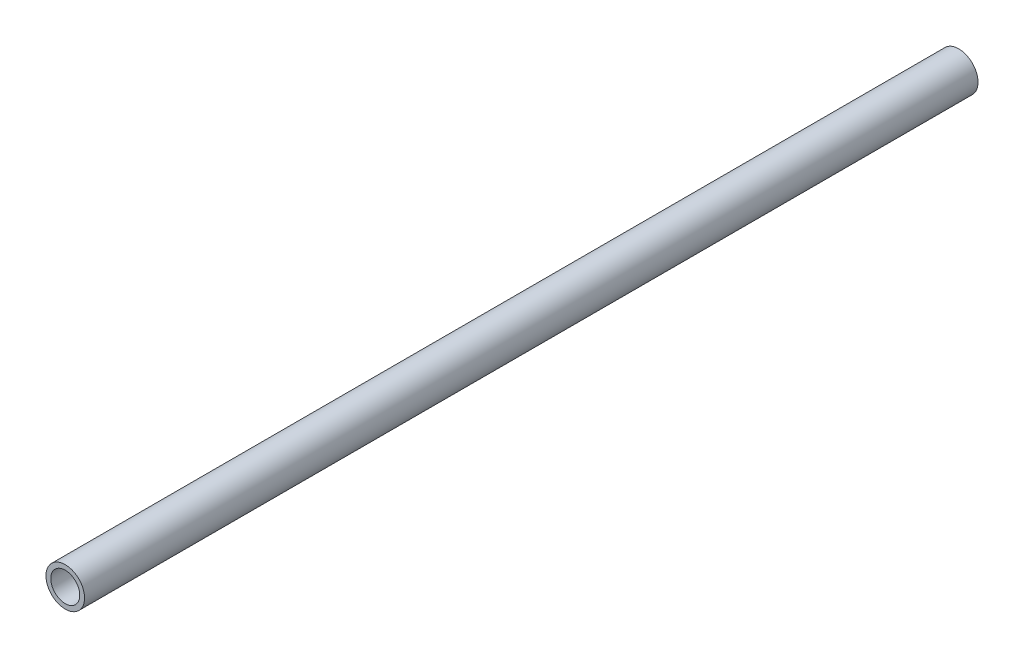
ISO-10303-21;
HEADER;
FILE_DESCRIPTION(('STEP AP214'),'2;1');
FILE_NAME('part.step','',(''),(''),'','','');
FILE_SCHEMA(('AUTOMOTIVE_DESIGN { 1 0 10303 214 1 1 1 1 }'));
ENDSEC;
DATA;
#1=APPLICATION_CONTEXT('core data for automotive mechanical design processes');
#2=APPLICATION_PROTOCOL_DEFINITION('international standard','automotive_design',2000,#1);
#3=PRODUCT_CONTEXT('',#1,'mechanical');
#4=PRODUCT('Part','Part','',(#3));
#5=PRODUCT_RELATED_PRODUCT_CATEGORY('part','',(#4));
#6=PRODUCT_DEFINITION_FORMATION('','',#4);
#7=PRODUCT_DEFINITION_CONTEXT('part definition',#1,'design');
#8=PRODUCT_DEFINITION('design','',#6,#7);
#9=PRODUCT_DEFINITION_SHAPE('','',#8);
#10=(LENGTH_UNIT() NAMED_UNIT(*) SI_UNIT(.MILLI.,.METRE.));
#11=(NAMED_UNIT(*) PLANE_ANGLE_UNIT() SI_UNIT($,.RADIAN.));
#12=(NAMED_UNIT(*) SI_UNIT($,.STERADIAN.) SOLID_ANGLE_UNIT());
#13=UNCERTAINTY_MEASURE_WITH_UNIT(LENGTH_MEASURE(1.E-05),#10,'distance_accuracy_value','');
#14=(GEOMETRIC_REPRESENTATION_CONTEXT(3) GLOBAL_UNCERTAINTY_ASSIGNED_CONTEXT((#13)) GLOBAL_UNIT_ASSIGNED_CONTEXT((#10,
#11,#12)) REPRESENTATION_CONTEXT('',''));
#15=CARTESIAN_POINT('',(0.,0.,0.));
#16=DIRECTION('',(0.,0.,1.));
#17=DIRECTION('',(1.,0.,0.));
#18=AXIS2_PLACEMENT_3D('',#15,#16,#17);
#19=CARTESIAN_POINT('',(0.,0.,278.892));
#20=DIRECTION('',(0.,0.,1.));
#21=DIRECTION('',(1.,0.,0.));
#22=AXIS2_PLACEMENT_3D('',#19,#20,#21);
#23=PLANE('',#22);
#24=CARTESIAN_POINT('',(0.,0.,278.892));
#25=DIRECTION('',(0.,0.,-1.));
#26=DIRECTION('',(-1.,0.,0.));
#27=AXIS2_PLACEMENT_3D('',#24,#25,#26);
#28=CIRCLE('',#27,4.7752);
#29=CARTESIAN_POINT('',(-4.7752,0.,278.892));
#30=VERTEX_POINT('',#29);
#31=EDGE_CURVE('E17',#30,#30,#28,.F.);
#32=ORIENTED_EDGE('',*,*,#31,.T.);
#33=EDGE_LOOP('',(#32));
#34=FACE_BOUND('',#33,.T.);
#35=ADVANCED_FACE('F14',(#34),#23,.T.);
#36=CARTESIAN_POINT('',(0.,0.,294.132));
#37=DIRECTION('',(0.,0.,-1.));
#38=DIRECTION('',(-1.,0.,0.));
#39=AXIS2_PLACEMENT_3D('',#36,#37,#38);
#40=CYLINDRICAL_SURFACE('',#39,4.7752);
#41=CARTESIAN_POINT('',(0.,0.,294.132));
#42=DIRECTION('',(0.,0.,-1.));
#43=DIRECTION('',(-1.,0.,0.));
#44=AXIS2_PLACEMENT_3D('',#41,#42,#43);
#45=CIRCLE('',#44,4.7752);
#46=CARTESIAN_POINT('',(-4.7752,0.,294.132));
#47=VERTEX_POINT('',#46);
#48=EDGE_CURVE('E26',#47,#47,#45,.T.);
#49=ORIENTED_EDGE('',*,*,#48,.F.);
#50=EDGE_LOOP('',(#49));
#51=FACE_BOUND('',#50,.T.);
#52=ORIENTED_EDGE('',*,*,#31,.F.);
#53=EDGE_LOOP('',(#52));
#54=FACE_BOUND('',#53,.T.);
#55=ADVANCED_FACE('F35',(#51,#54),#40,.F.);
#56=CARTESIAN_POINT('',(0.,0.,294.132));
#57=DIRECTION('',(0.,0.,1.));
#58=DIRECTION('',(1.,0.,0.));
#59=AXIS2_PLACEMENT_3D('',#56,#57,#58);
#60=PLANE('',#59);
#61=CARTESIAN_POINT('',(0.,0.,294.132));
#62=DIRECTION('',(0.,0.,1.));
#63=DIRECTION('',(1.,0.,0.));
#64=AXIS2_PLACEMENT_3D('',#61,#62,#63);
#65=CIRCLE('',#64,6.35);
#66=CARTESIAN_POINT('',(6.35,0.,294.132));
#67=VERTEX_POINT('',#66);
#68=EDGE_CURVE('E21',#67,#67,#65,.F.);
#69=ORIENTED_EDGE('',*,*,#68,.F.);
#70=EDGE_LOOP('',(#69));
#71=FACE_BOUND('',#70,.T.);
#72=ORIENTED_EDGE('',*,*,#48,.T.);
#73=EDGE_LOOP('',(#72));
#74=FACE_BOUND('',#73,.T.);
#75=ADVANCED_FACE('F37',(#71,#74),#60,.T.);
#76=CARTESIAN_POINT('',(0.,0.,0.));
#77=DIRECTION('',(0.,0.,1.));
#78=DIRECTION('',(1.,0.,0.));
#79=AXIS2_PLACEMENT_3D('',#76,#77,#78);
#80=PLANE('',#79);
#81=CARTESIAN_POINT('',(0.,0.,0.));
#82=DIRECTION('',(0.,0.,1.));
#83=DIRECTION('',(1.,0.,0.));
#84=AXIS2_PLACEMENT_3D('',#81,#82,#83);
#85=CIRCLE('',#84,6.35);
#86=CARTESIAN_POINT('',(6.35,0.,0.));
#87=VERTEX_POINT('',#86);
#88=EDGE_CURVE('E10',#87,#87,#85,.T.);
#89=ORIENTED_EDGE('',*,*,#88,.F.);
#90=EDGE_LOOP('',(#89));
#91=FACE_BOUND('',#90,.T.);
#92=ADVANCED_FACE('F44',(#91),#80,.F.);
#93=CARTESIAN_POINT('',(0.,0.,0.));
#94=DIRECTION('',(0.,0.,1.));
#95=DIRECTION('',(1.,0.,0.));
#96=AXIS2_PLACEMENT_3D('',#93,#94,#95);
#97=CYLINDRICAL_SURFACE('',#96,6.35);
#98=ORIENTED_EDGE('',*,*,#88,.T.);
#99=EDGE_LOOP('',(#98));
#100=FACE_BOUND('',#99,.T.);
#101=ORIENTED_EDGE('',*,*,#68,.T.);
#102=EDGE_LOOP('',(#101));
#103=FACE_BOUND('',#102,.T.);
#104=ADVANCED_FACE('F47',(#100,#103),#97,.T.);
#105=CLOSED_SHELL('',(#35,#55,#75,#92,#104));
#106=MANIFOLD_SOLID_BREP('B1',#105);
#107=ADVANCED_BREP_SHAPE_REPRESENTATION('',(#18,#106),#14);
#108=SHAPE_DEFINITION_REPRESENTATION(#9,#107);
ENDSEC;
END-ISO-10303-21;
